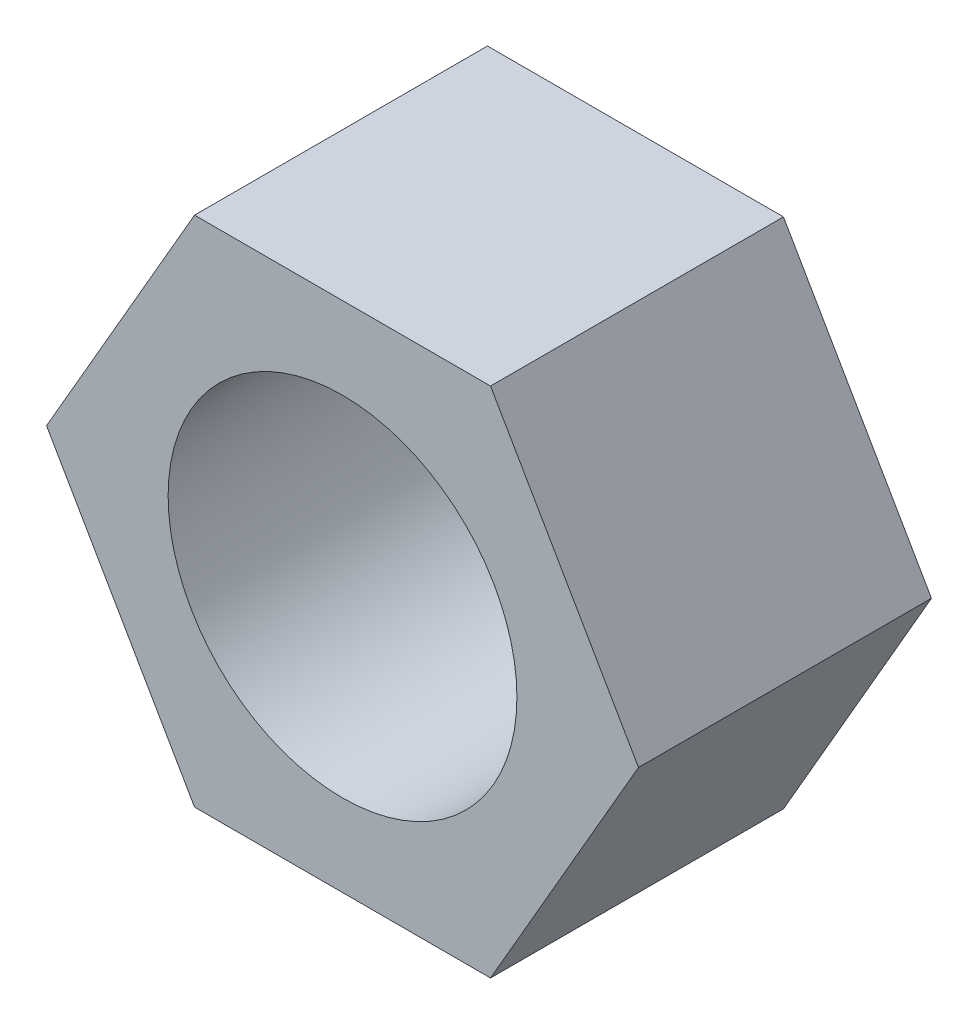
ISO-10303-21;
HEADER;
FILE_DESCRIPTION(('STEP AP214'),'2;1');
FILE_NAME('part.step','',(''),(''),'','','');
FILE_SCHEMA(('AUTOMOTIVE_DESIGN { 1 0 10303 214 1 1 1 1 }'));
ENDSEC;
DATA;
#1=APPLICATION_CONTEXT('core data for automotive mechanical design processes');
#2=APPLICATION_PROTOCOL_DEFINITION('international standard','automotive_design',2000,#1);
#3=PRODUCT_CONTEXT('',#1,'mechanical');
#4=PRODUCT('Part','Part','',(#3));
#5=PRODUCT_RELATED_PRODUCT_CATEGORY('part','',(#4));
#6=PRODUCT_DEFINITION_FORMATION('','',#4);
#7=PRODUCT_DEFINITION_CONTEXT('part definition',#1,'design');
#8=PRODUCT_DEFINITION('design','',#6,#7);
#9=PRODUCT_DEFINITION_SHAPE('','',#8);
#10=(LENGTH_UNIT() NAMED_UNIT(*) SI_UNIT(.MILLI.,.METRE.));
#11=(NAMED_UNIT(*) PLANE_ANGLE_UNIT() SI_UNIT($,.RADIAN.));
#12=(NAMED_UNIT(*) SI_UNIT($,.STERADIAN.) SOLID_ANGLE_UNIT());
#13=UNCERTAINTY_MEASURE_WITH_UNIT(LENGTH_MEASURE(1.E-05),#10,'distance_accuracy_value','');
#14=(GEOMETRIC_REPRESENTATION_CONTEXT(3) GLOBAL_UNCERTAINTY_ASSIGNED_CONTEXT((#13)) GLOBAL_UNIT_ASSIGNED_CONTEXT((#10,
#11,#12)) REPRESENTATION_CONTEXT('',''));
#15=CARTESIAN_POINT('',(0.,0.,0.));
#16=DIRECTION('',(0.,0.,1.));
#17=DIRECTION('',(1.,0.,0.));
#18=AXIS2_PLACEMENT_3D('',#15,#16,#17);
#19=CARTESIAN_POINT('',(4.04145188432738,-7.00000000000001,8.));
#20=DIRECTION('',(-0.866025403784438,0.5,0.));
#21=DIRECTION('',(-0.5,-0.866025403784439,0.));
#22=AXIS2_PLACEMENT_3D('',#19,#20,#21);
#23=PLANE('',#22);
#24=DIRECTION('',(0.5,0.866025403784438,0.));
#25=VECTOR('',#24,1.);
#26=CARTESIAN_POINT('',(4.04145188432738,-7.00000000000001,0.));
#27=LINE('',#26,#25);
#28=CARTESIAN_POINT('',(4.04145188432738,-7.00000000000001,0.));
#29=VERTEX_POINT('',#28);
#30=CARTESIAN_POINT('',(8.08290376865477,0.,0.));
#31=VERTEX_POINT('',#30);
#32=EDGE_CURVE('E117',#29,#31,#27,.T.);
#33=ORIENTED_EDGE('',*,*,#32,.T.);
#34=DIRECTION('',(0.,0.,-1.));
#35=VECTOR('',#34,1.);
#36=CARTESIAN_POINT('',(8.08290376865477,0.,8.));
#37=LINE('',#36,#35);
#38=CARTESIAN_POINT('',(8.08290376865477,0.,8.));
#39=VERTEX_POINT('',#38);
#40=EDGE_CURVE('E11',#39,#31,#37,.T.);
#41=ORIENTED_EDGE('',*,*,#40,.F.);
#42=DIRECTION('',(0.5,0.866025403784438,0.));
#43=VECTOR('',#42,1.);
#44=CARTESIAN_POINT('',(4.04145188432738,-7.00000000000001,8.));
#45=LINE('',#44,#43);
#46=CARTESIAN_POINT('',(4.04145188432738,-7.00000000000001,8.));
#47=VERTEX_POINT('',#46);
#48=EDGE_CURVE('E128',#47,#39,#45,.T.);
#49=ORIENTED_EDGE('',*,*,#48,.F.);
#50=DIRECTION('',(0.,0.,-1.));
#51=VECTOR('',#50,1.);
#52=CARTESIAN_POINT('',(4.04145188432738,-7.00000000000001,8.));
#53=LINE('',#52,#51);
#54=EDGE_CURVE('E113',#47,#29,#53,.T.);
#55=ORIENTED_EDGE('',*,*,#54,.T.);
#56=EDGE_LOOP('',(#33,#41,#49,#55));
#57=FACE_BOUND('',#56,.T.);
#58=ADVANCED_FACE('F33',(#57),#23,.F.);
#59=CARTESIAN_POINT('',(8.08290376865477,0.,8.));
#60=DIRECTION('',(-0.866025403784439,-0.5,0.));
#61=DIRECTION('',(0.5,-0.866025403784439,0.));
#62=AXIS2_PLACEMENT_3D('',#59,#60,#61);
#63=PLANE('',#62);
#64=DIRECTION('',(-0.5,0.866025403784438,0.));
#65=VECTOR('',#64,1.);
#66=CARTESIAN_POINT('',(8.08290376865477,0.,0.));
#67=LINE('',#66,#65);
#68=CARTESIAN_POINT('',(4.04145188432738,7.00000000000002,0.));
#69=VERTEX_POINT('',#68);
#70=EDGE_CURVE('E120',#31,#69,#67,.T.);
#71=ORIENTED_EDGE('',*,*,#70,.T.);
#72=DIRECTION('',(0.,0.,-1.));
#73=VECTOR('',#72,1.);
#74=CARTESIAN_POINT('',(4.04145188432738,7.00000000000002,8.));
#75=LINE('',#74,#73);
#76=CARTESIAN_POINT('',(4.04145188432738,7.00000000000002,8.));
#77=VERTEX_POINT('',#76);
#78=EDGE_CURVE('E41',#77,#69,#75,.T.);
#79=ORIENTED_EDGE('',*,*,#78,.F.);
#80=DIRECTION('',(-0.5,0.866025403784438,0.));
#81=VECTOR('',#80,1.);
#82=CARTESIAN_POINT('',(8.08290376865477,0.,8.));
#83=LINE('',#82,#81);
#84=EDGE_CURVE('E86',#39,#77,#83,.T.);
#85=ORIENTED_EDGE('',*,*,#84,.F.);
#86=ORIENTED_EDGE('',*,*,#40,.T.);
#87=EDGE_LOOP('',(#71,#79,#85,#86));
#88=FACE_BOUND('',#87,.T.);
#89=ADVANCED_FACE('F153',(#88),#63,.F.);
#90=CARTESIAN_POINT('',(4.04145188432738,7.00000000000002,8.));
#91=DIRECTION('',(0.,-1.,0.));
#92=DIRECTION('',(0.,0.,-1.));
#93=AXIS2_PLACEMENT_3D('',#90,#91,#92);
#94=PLANE('',#93);
#95=DIRECTION('',(-1.,0.,0.));
#96=VECTOR('',#95,1.);
#97=CARTESIAN_POINT('',(4.04145188432738,7.00000000000002,0.));
#98=LINE('',#97,#96);
#99=CARTESIAN_POINT('',(-4.04145188432739,7.00000000000002,0.));
#100=VERTEX_POINT('',#99);
#101=EDGE_CURVE('E123',#69,#100,#98,.T.);
#102=ORIENTED_EDGE('',*,*,#101,.T.);
#103=DIRECTION('',(0.,0.,-1.));
#104=VECTOR('',#103,1.);
#105=CARTESIAN_POINT('',(-4.04145188432739,7.00000000000002,8.));
#106=LINE('',#105,#104);
#107=CARTESIAN_POINT('',(-4.04145188432739,7.00000000000002,8.));
#108=VERTEX_POINT('',#107);
#109=EDGE_CURVE('E108',#108,#100,#106,.T.);
#110=ORIENTED_EDGE('',*,*,#109,.F.);
#111=DIRECTION('',(-1.,0.,0.));
#112=VECTOR('',#111,1.);
#113=CARTESIAN_POINT('',(4.04145188432738,7.00000000000002,8.));
#114=LINE('',#113,#112);
#115=EDGE_CURVE('E99',#77,#108,#114,.T.);
#116=ORIENTED_EDGE('',*,*,#115,.F.);
#117=ORIENTED_EDGE('',*,*,#78,.T.);
#118=EDGE_LOOP('',(#102,#110,#116,#117));
#119=FACE_BOUND('',#118,.T.);
#120=ADVANCED_FACE('F134',(#119),#94,.F.);
#121=CARTESIAN_POINT('',(-4.04145188432739,7.00000000000002,8.));
#122=DIRECTION('',(0.866025403784439,-0.499999999999999,0.));
#123=DIRECTION('',(0.5,0.866025403784439,0.));
#124=AXIS2_PLACEMENT_3D('',#121,#122,#123);
#125=PLANE('',#124);
#126=DIRECTION('',(-0.499999999999999,-0.866025403784439,0.));
#127=VECTOR('',#126,1.);
#128=CARTESIAN_POINT('',(-4.04145188432739,7.00000000000002,0.));
#129=LINE('',#128,#127);
#130=CARTESIAN_POINT('',(-8.08290376865477,0.,0.));
#131=VERTEX_POINT('',#130);
#132=EDGE_CURVE('E107',#100,#131,#129,.T.);
#133=ORIENTED_EDGE('',*,*,#132,.T.);
#134=DIRECTION('',(0.,0.,-1.));
#135=VECTOR('',#134,1.);
#136=CARTESIAN_POINT('',(-8.08290376865477,0.,8.));
#137=LINE('',#136,#135);
#138=CARTESIAN_POINT('',(-8.08290376865477,0.,8.));
#139=VERTEX_POINT('',#138);
#140=EDGE_CURVE('E104',#139,#131,#137,.T.);
#141=ORIENTED_EDGE('',*,*,#140,.F.);
#142=DIRECTION('',(-0.499999999999999,-0.866025403784439,0.));
#143=VECTOR('',#142,1.);
#144=CARTESIAN_POINT('',(-4.04145188432739,7.00000000000002,8.));
#145=LINE('',#144,#143);
#146=EDGE_CURVE('E93',#108,#139,#145,.T.);
#147=ORIENTED_EDGE('',*,*,#146,.F.);
#148=ORIENTED_EDGE('',*,*,#109,.T.);
#149=EDGE_LOOP('',(#133,#141,#147,#148));
#150=FACE_BOUND('',#149,.T.);
#151=ADVANCED_FACE('F105',(#150),#125,.F.);
#152=CARTESIAN_POINT('',(-8.08290376865477,0.,8.));
#153=DIRECTION('',(0.866025403784439,0.5,0.));
#154=DIRECTION('',(-0.5,0.866025403784439,0.));
#155=AXIS2_PLACEMENT_3D('',#152,#153,#154);
#156=PLANE('',#155);
#157=DIRECTION('',(0.5,-0.866025403784439,0.));
#158=VECTOR('',#157,1.);
#159=CARTESIAN_POINT('',(-8.08290376865477,0.,0.));
#160=LINE('',#159,#158);
#161=CARTESIAN_POINT('',(-4.04145188432739,-7.00000000000001,0.));
#162=VERTEX_POINT('',#161);
#163=EDGE_CURVE('E72',#131,#162,#160,.T.);
#164=ORIENTED_EDGE('',*,*,#163,.T.);
#165=DIRECTION('',(0.,0.,-1.));
#166=VECTOR('',#165,1.);
#167=CARTESIAN_POINT('',(-4.04145188432739,-7.00000000000001,8.));
#168=LINE('',#167,#166);
#169=CARTESIAN_POINT('',(-4.04145188432739,-7.00000000000001,8.));
#170=VERTEX_POINT('',#169);
#171=EDGE_CURVE('E109',#170,#162,#168,.T.);
#172=ORIENTED_EDGE('',*,*,#171,.F.);
#173=DIRECTION('',(0.5,-0.866025403784439,0.));
#174=VECTOR('',#173,1.);
#175=CARTESIAN_POINT('',(-8.08290376865477,0.,8.));
#176=LINE('',#175,#174);
#177=EDGE_CURVE('E97',#139,#170,#176,.T.);
#178=ORIENTED_EDGE('',*,*,#177,.F.);
#179=ORIENTED_EDGE('',*,*,#140,.T.);
#180=EDGE_LOOP('',(#164,#172,#178,#179));
#181=FACE_BOUND('',#180,.T.);
#182=ADVANCED_FACE('F111',(#181),#156,.F.);
#183=CARTESIAN_POINT('',(-4.04145188432739,-7.00000000000001,8.));
#184=DIRECTION('',(0.,1.,0.));
#185=DIRECTION('',(0.,0.,1.));
#186=AXIS2_PLACEMENT_3D('',#183,#184,#185);
#187=PLANE('',#186);
#188=DIRECTION('',(1.,0.,0.));
#189=VECTOR('',#188,1.);
#190=CARTESIAN_POINT('',(-4.04145188432739,-7.00000000000001,0.));
#191=LINE('',#190,#189);
#192=EDGE_CURVE('E78',#162,#29,#191,.T.);
#193=ORIENTED_EDGE('',*,*,#192,.T.);
#194=ORIENTED_EDGE('',*,*,#54,.F.);
#195=DIRECTION('',(1.,0.,0.));
#196=VECTOR('',#195,1.);
#197=CARTESIAN_POINT('',(-4.04145188432739,-7.00000000000001,8.));
#198=LINE('',#197,#196);
#199=EDGE_CURVE('E49',#170,#47,#198,.T.);
#200=ORIENTED_EDGE('',*,*,#199,.F.);
#201=ORIENTED_EDGE('',*,*,#171,.T.);
#202=EDGE_LOOP('',(#193,#194,#200,#201));
#203=FACE_BOUND('',#202,.T.);
#204=ADVANCED_FACE('F141',(#203),#187,.F.);
#205=CARTESIAN_POINT('',(0.,0.,8.));
#206=DIRECTION('',(0.,0.,1.));
#207=DIRECTION('',(1.,0.,0.));
#208=AXIS2_PLACEMENT_3D('',#205,#206,#207);
#209=PLANE('',#208);
#210=CARTESIAN_POINT('',(0.,0.,8.));
#211=DIRECTION('',(0.,0.,-1.));
#212=DIRECTION('',(-1.,0.,0.));
#213=AXIS2_PLACEMENT_3D('',#210,#211,#212);
#214=CIRCLE('',#213,4.7625);
#215=CARTESIAN_POINT('',(-4.7625,0.,8.));
#216=VERTEX_POINT('',#215);
#217=EDGE_CURVE('E121',#216,#216,#214,.T.);
#218=ORIENTED_EDGE('',*,*,#217,.T.);
#219=EDGE_LOOP('',(#218));
#220=FACE_BOUND('',#219,.T.);
#221=ORIENTED_EDGE('',*,*,#48,.T.);
#222=ORIENTED_EDGE('',*,*,#84,.T.);
#223=ORIENTED_EDGE('',*,*,#115,.T.);
#224=ORIENTED_EDGE('',*,*,#146,.T.);
#225=ORIENTED_EDGE('',*,*,#177,.T.);
#226=ORIENTED_EDGE('',*,*,#199,.T.);
#227=EDGE_LOOP('',(#221,#222,#223,#224,#225,#226));
#228=FACE_BOUND('',#227,.T.);
#229=ADVANCED_FACE('F95',(#220,#228),#209,.T.);
#230=CARTESIAN_POINT('',(0.,0.,0.));
#231=DIRECTION('',(0.,0.,1.));
#232=DIRECTION('',(1.,0.,0.));
#233=AXIS2_PLACEMENT_3D('',#230,#231,#232);
#234=PLANE('',#233);
#235=CARTESIAN_POINT('',(0.,0.,0.));
#236=DIRECTION('',(0.,0.,-1.));
#237=DIRECTION('',(-1.,0.,0.));
#238=AXIS2_PLACEMENT_3D('',#235,#236,#237);
#239=CIRCLE('',#238,4.7625);
#240=CARTESIAN_POINT('',(-4.7625,0.,0.));
#241=VERTEX_POINT('',#240);
#242=EDGE_CURVE('E208',#241,#241,#239,.T.);
#243=ORIENTED_EDGE('',*,*,#242,.F.);
#244=EDGE_LOOP('',(#243));
#245=FACE_BOUND('',#244,.T.);
#246=ORIENTED_EDGE('',*,*,#32,.F.);
#247=ORIENTED_EDGE('',*,*,#192,.F.);
#248=ORIENTED_EDGE('',*,*,#163,.F.);
#249=ORIENTED_EDGE('',*,*,#132,.F.);
#250=ORIENTED_EDGE('',*,*,#101,.F.);
#251=ORIENTED_EDGE('',*,*,#70,.F.);
#252=EDGE_LOOP('',(#246,#247,#248,#249,#250,#251));
#253=FACE_BOUND('',#252,.T.);
#254=ADVANCED_FACE('F137',(#245,#253),#234,.F.);
#255=CARTESIAN_POINT('',(0.,0.,8.));
#256=DIRECTION('',(0.,0.,-1.));
#257=DIRECTION('',(-1.,0.,0.));
#258=AXIS2_PLACEMENT_3D('',#255,#256,#257);
#259=CYLINDRICAL_SURFACE('',#258,4.7625);
#260=ORIENTED_EDGE('',*,*,#217,.F.);
#261=EDGE_LOOP('',(#260));
#262=FACE_BOUND('',#261,.T.);
#263=ORIENTED_EDGE('',*,*,#242,.T.);
#264=EDGE_LOOP('',(#263));
#265=FACE_BOUND('',#264,.T.);
#266=ADVANCED_FACE('F190',(#262,#265),#259,.F.);
#267=CLOSED_SHELL('',(#58,#89,#120,#151,#182,#204,#229,#254,#266));
#268=MANIFOLD_SOLID_BREP('B2',#267);
#269=ADVANCED_BREP_SHAPE_REPRESENTATION('',(#18,#268),#14);
#270=SHAPE_DEFINITION_REPRESENTATION(#9,#269);
ENDSEC;
END-ISO-10303-21;
